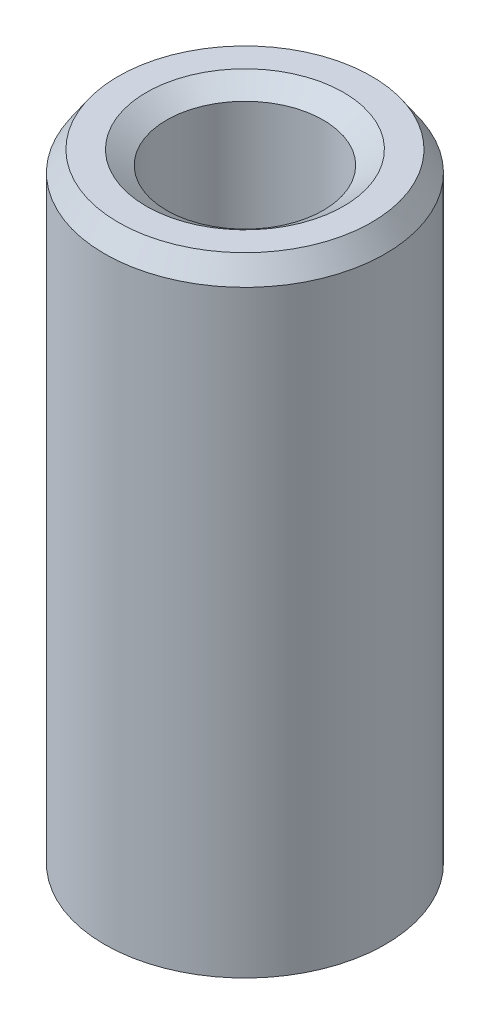
ISO-10303-21;
HEADER;
FILE_DESCRIPTION(('STEP AP214'),'2;1');
FILE_NAME('part.step','',(''),(''),'','','');
FILE_SCHEMA(('AUTOMOTIVE_DESIGN { 1 0 10303 214 1 1 1 1 }'));
ENDSEC;
DATA;
#1=APPLICATION_CONTEXT('core data for automotive mechanical design processes');
#2=APPLICATION_PROTOCOL_DEFINITION('international standard','automotive_design',2000,#1);
#3=PRODUCT_CONTEXT('',#1,'mechanical');
#4=PRODUCT('Part','Part','',(#3));
#5=PRODUCT_RELATED_PRODUCT_CATEGORY('part','',(#4));
#6=PRODUCT_DEFINITION_FORMATION('','',#4);
#7=PRODUCT_DEFINITION_CONTEXT('part definition',#1,'design');
#8=PRODUCT_DEFINITION('design','',#6,#7);
#9=PRODUCT_DEFINITION_SHAPE('','',#8);
#10=(LENGTH_UNIT() NAMED_UNIT(*) SI_UNIT(.MILLI.,.METRE.));
#11=(NAMED_UNIT(*) PLANE_ANGLE_UNIT() SI_UNIT($,.RADIAN.));
#12=(NAMED_UNIT(*) SI_UNIT($,.STERADIAN.) SOLID_ANGLE_UNIT());
#13=UNCERTAINTY_MEASURE_WITH_UNIT(LENGTH_MEASURE(1.E-05),#10,'distance_accuracy_value','');
#14=(GEOMETRIC_REPRESENTATION_CONTEXT(3) GLOBAL_UNCERTAINTY_ASSIGNED_CONTEXT((#13)) GLOBAL_UNIT_ASSIGNED_CONTEXT((#10,
#11,#12)) REPRESENTATION_CONTEXT('',''));
#15=CARTESIAN_POINT('',(0.,0.,0.));
#16=DIRECTION('',(0.,0.,1.));
#17=DIRECTION('',(1.,0.,0.));
#18=AXIS2_PLACEMENT_3D('',#15,#16,#17);
#19=CARTESIAN_POINT('',(0.,45.0358328551466,0.));
#20=DIRECTION('',(0.,-1.,0.));
#21=DIRECTION('',(0.,0.,-1.));
#22=AXIS2_PLACEMENT_3D('',#19,#20,#21);
#23=CYLINDRICAL_SURFACE('',#22,10.);
#24=CARTESIAN_POINT('',(0.,0.979937343326215,0.));
#25=DIRECTION('',(0.,1.,0.));
#26=DIRECTION('',(0.,0.,1.));
#27=AXIS2_PLACEMENT_3D('',#24,#25,#26);
#28=CIRCLE('',#27,10.);
#29=CARTESIAN_POINT('',(0.,0.979937343326215,10.));
#30=VERTEX_POINT('',#29);
#31=EDGE_CURVE('E10',#30,#30,#28,.T.);
#32=ORIENTED_EDGE('',*,*,#31,.T.);
#33=EDGE_LOOP('',(#32));
#34=FACE_BOUND('',#33,.T.);
#35=CARTESIAN_POINT('',(0.,43.5888726821018,0.));
#36=DIRECTION('',(0.,1.,0.));
#37=DIRECTION('',(0.,0.,1.));
#38=AXIS2_PLACEMENT_3D('',#35,#36,#37);
#39=CIRCLE('',#38,10.);
#40=CARTESIAN_POINT('',(0.,43.5888726821018,10.));
#41=VERTEX_POINT('',#40);
#42=EDGE_CURVE('E50',#41,#41,#39,.F.);
#43=ORIENTED_EDGE('',*,*,#42,.T.);
#44=EDGE_LOOP('',(#43));
#45=FACE_BOUND('',#44,.T.);
#46=ADVANCED_FACE('F39',(#34,#45),#23,.T.);
#47=CARTESIAN_POINT('',(0.,45.0358328551466,0.));
#48=DIRECTION('',(0.,1.,0.));
#49=DIRECTION('',(0.,0.,1.));
#50=AXIS2_PLACEMENT_3D('',#47,#48,#49);
#51=PLANE('',#50);
#52=CARTESIAN_POINT('',(0.,45.0358328551466,0.));
#53=DIRECTION('',(0.,1.,0.));
#54=DIRECTION('',(0.,0.,1.));
#55=AXIS2_PLACEMENT_3D('',#52,#53,#54);
#56=CIRCLE('',#55,7.02670629191836);
#57=CARTESIAN_POINT('',(0.,45.0358328551466,7.02670629191836));
#58=VERTEX_POINT('',#57);
#59=EDGE_CURVE('E58',#58,#58,#56,.F.);
#60=ORIENTED_EDGE('',*,*,#59,.T.);
#61=EDGE_LOOP('',(#60));
#62=FACE_BOUND('',#61,.T.);
#63=CARTESIAN_POINT('',(0.,45.0358328551466,0.));
#64=DIRECTION('',(0.,1.,0.));
#65=DIRECTION('',(0.,0.,1.));
#66=AXIS2_PLACEMENT_3D('',#63,#64,#65);
#67=CIRCLE('',#66,9.02006265667378);
#68=CARTESIAN_POINT('',(0.,45.0358328551466,9.02006265667378));
#69=VERTEX_POINT('',#68);
#70=EDGE_CURVE('E61',#69,#69,#67,.T.);
#71=ORIENTED_EDGE('',*,*,#70,.T.);
#72=EDGE_LOOP('',(#71));
#73=FACE_BOUND('',#72,.T.);
#74=ADVANCED_FACE('F88',(#62,#73),#51,.T.);
#75=CARTESIAN_POINT('',(0.,0.,0.));
#76=DIRECTION('',(0.,1.,0.));
#77=DIRECTION('',(0.,0.,1.));
#78=AXIS2_PLACEMENT_3D('',#75,#76,#77);
#79=PLANE('',#78);
#80=CARTESIAN_POINT('',(0.,0.,0.));
#81=DIRECTION('',(0.,1.,0.));
#82=DIRECTION('',(0.,0.,1.));
#83=AXIS2_PLACEMENT_3D('',#80,#81,#82);
#84=CIRCLE('',#83,6.55968346219973);
#85=CARTESIAN_POINT('',(0.,0.,6.55968346219973));
#86=VERTEX_POINT('',#85);
#87=EDGE_CURVE('E51',#86,#86,#84,.T.);
#88=ORIENTED_EDGE('',*,*,#87,.T.);
#89=EDGE_LOOP('',(#88));
#90=FACE_BOUND('',#89,.T.);
#91=CARTESIAN_POINT('',(0.,0.,0.));
#92=DIRECTION('',(0.,1.,0.));
#93=DIRECTION('',(0.,0.,1.));
#94=AXIS2_PLACEMENT_3D('',#91,#92,#93);
#95=CIRCLE('',#94,8.55303982695518);
#96=CARTESIAN_POINT('',(0.,0.,8.55303982695518));
#97=VERTEX_POINT('',#96);
#98=EDGE_CURVE('E54',#97,#97,#95,.F.);
#99=ORIENTED_EDGE('',*,*,#98,.T.);
#100=EDGE_LOOP('',(#99));
#101=FACE_BOUND('',#100,.T.);
#102=ADVANCED_FACE('F83',(#90,#101),#79,.F.);
#103=CARTESIAN_POINT('',(0.,45.0358328551466,0.));
#104=DIRECTION('',(0.,-1.,0.));
#105=DIRECTION('',(0.,0.,-1.));
#106=AXIS2_PLACEMENT_3D('',#103,#104,#105);
#107=CYLINDRICAL_SURFACE('',#106,5.57974611887351);
#108=CARTESIAN_POINT('',(0.,44.0558955118204,0.));
#109=DIRECTION('',(0.,1.,0.));
#110=DIRECTION('',(0.,0.,1.));
#111=AXIS2_PLACEMENT_3D('',#108,#109,#110);
#112=CIRCLE('',#111,5.57974611887351);
#113=CARTESIAN_POINT('',(0.,44.0558955118204,5.57974611887351));
#114=VERTEX_POINT('',#113);
#115=EDGE_CURVE('E67',#114,#114,#112,.T.);
#116=ORIENTED_EDGE('',*,*,#115,.T.);
#117=EDGE_LOOP('',(#116));
#118=FACE_BOUND('',#117,.T.);
#119=CARTESIAN_POINT('',(0.,1.44696017304483,0.));
#120=DIRECTION('',(0.,1.,0.));
#121=DIRECTION('',(0.,0.,1.));
#122=AXIS2_PLACEMENT_3D('',#119,#120,#121);
#123=CIRCLE('',#122,5.57974611887351);
#124=CARTESIAN_POINT('',(0.,1.44696017304483,5.57974611887351));
#125=VERTEX_POINT('',#124);
#126=EDGE_CURVE('E69',#125,#125,#123,.F.);
#127=ORIENTED_EDGE('',*,*,#126,.T.);
#128=EDGE_LOOP('',(#127));
#129=FACE_BOUND('',#128,.T.);
#130=ADVANCED_FACE('F71',(#118,#129),#107,.F.);
#131=CARTESIAN_POINT('',(0.,44.0558955118204,0.));
#132=DIRECTION('',(0.,1.,0.));
#133=DIRECTION('',(0.,0.,1.));
#134=AXIS2_PLACEMENT_3D('',#131,#132,#133);
#135=CONICAL_SURFACE('',#134,5.57974611887351,0.97551033087563);
#136=ORIENTED_EDGE('',*,*,#59,.F.);
#137=EDGE_LOOP('',(#136));
#138=FACE_BOUND('',#137,.T.);
#139=ORIENTED_EDGE('',*,*,#115,.F.);
#140=EDGE_LOOP('',(#139));
#141=FACE_BOUND('',#140,.T.);
#142=ADVANCED_FACE('F77',(#138,#141),#135,.F.);
#143=CARTESIAN_POINT('',(0.,0.,0.));
#144=DIRECTION('',(0.,-1.,0.));
#145=DIRECTION('',(0.,0.,-1.));
#146=AXIS2_PLACEMENT_3D('',#143,#144,#145);
#147=CONICAL_SURFACE('',#146,6.55968346219973,0.595285995919265);
#148=ORIENTED_EDGE('',*,*,#126,.F.);
#149=EDGE_LOOP('',(#148));
#150=FACE_BOUND('',#149,.T.);
#151=ORIENTED_EDGE('',*,*,#87,.F.);
#152=EDGE_LOOP('',(#151));
#153=FACE_BOUND('',#152,.T.);
#154=ADVANCED_FACE('F73',(#150,#153),#147,.F.);
#155=CARTESIAN_POINT('',(0.,0.979937343326215,0.));
#156=DIRECTION('',(0.,1.,0.));
#157=DIRECTION('',(0.,0.,1.));
#158=AXIS2_PLACEMENT_3D('',#155,#156,#157);
#159=CONICAL_SURFACE('',#158,10.,0.975510330875631);
#160=ORIENTED_EDGE('',*,*,#98,.F.);
#161=EDGE_LOOP('',(#160));
#162=FACE_BOUND('',#161,.T.);
#163=ORIENTED_EDGE('',*,*,#31,.F.);
#164=EDGE_LOOP('',(#163));
#165=FACE_BOUND('',#164,.T.);
#166=ADVANCED_FACE('F76',(#162,#165),#159,.T.);
#167=CARTESIAN_POINT('',(0.,45.0358328551466,0.));
#168=DIRECTION('',(0.,-1.,0.));
#169=DIRECTION('',(0.,0.,-1.));
#170=AXIS2_PLACEMENT_3D('',#167,#168,#169);
#171=CONICAL_SURFACE('',#170,9.02006265667378,0.595285995919265);
#172=ORIENTED_EDGE('',*,*,#42,.F.);
#173=EDGE_LOOP('',(#172));
#174=FACE_BOUND('',#173,.T.);
#175=ORIENTED_EDGE('',*,*,#70,.F.);
#176=EDGE_LOOP('',(#175));
#177=FACE_BOUND('',#176,.T.);
#178=ADVANCED_FACE('F45',(#174,#177),#171,.T.);
#179=CLOSED_SHELL('',(#46,#74,#102,#130,#142,#154,#166,#178));
#180=MANIFOLD_SOLID_BREP('B2',#179);
#181=ADVANCED_BREP_SHAPE_REPRESENTATION('',(#18,#180),#14);
#182=SHAPE_DEFINITION_REPRESENTATION(#9,#181);
ENDSEC;
END-ISO-10303-21;
